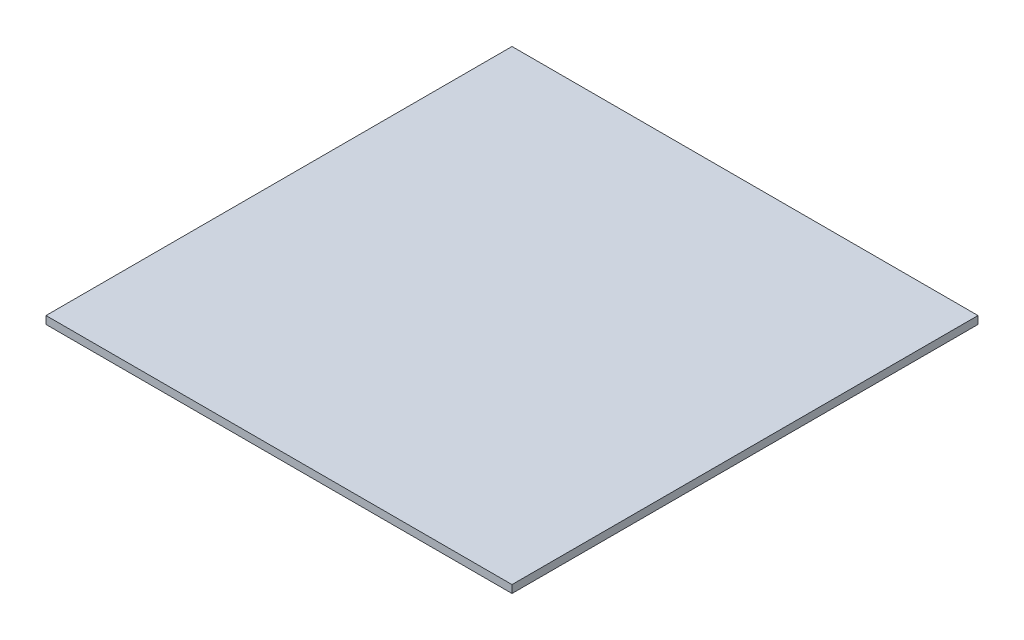
ISO-10303-21;
HEADER;
FILE_DESCRIPTION(('STEP AP214'),'2;1');
FILE_NAME('part.step','',(''),(''),'','','');
FILE_SCHEMA(('AUTOMOTIVE_DESIGN { 1 0 10303 214 1 1 1 1 }'));
ENDSEC;
DATA;
#1=APPLICATION_CONTEXT('core data for automotive mechanical design processes');
#2=APPLICATION_PROTOCOL_DEFINITION('international standard','automotive_design',2000,#1);
#3=PRODUCT_CONTEXT('',#1,'mechanical');
#4=PRODUCT('Part','Part','',(#3));
#5=PRODUCT_RELATED_PRODUCT_CATEGORY('part','',(#4));
#6=PRODUCT_DEFINITION_FORMATION('','',#4);
#7=PRODUCT_DEFINITION_CONTEXT('part definition',#1,'design');
#8=PRODUCT_DEFINITION('design','',#6,#7);
#9=PRODUCT_DEFINITION_SHAPE('','',#8);
#10=(LENGTH_UNIT() NAMED_UNIT(*) SI_UNIT(.MILLI.,.METRE.));
#11=(NAMED_UNIT(*) PLANE_ANGLE_UNIT() SI_UNIT($,.RADIAN.));
#12=(NAMED_UNIT(*) SI_UNIT($,.STERADIAN.) SOLID_ANGLE_UNIT());
#13=UNCERTAINTY_MEASURE_WITH_UNIT(LENGTH_MEASURE(1.E-05),#10,'distance_accuracy_value','');
#14=(GEOMETRIC_REPRESENTATION_CONTEXT(3) GLOBAL_UNCERTAINTY_ASSIGNED_CONTEXT((#13)) GLOBAL_UNIT_ASSIGNED_CONTEXT((#10,
#11,#12)) REPRESENTATION_CONTEXT('',''));
#15=CARTESIAN_POINT('',(0.,0.,0.));
#16=DIRECTION('',(0.,0.,1.));
#17=DIRECTION('',(1.,0.,0.));
#18=AXIS2_PLACEMENT_3D('',#15,#16,#17);
#19=CARTESIAN_POINT('',(-95.25,3.175,-95.25));
#20=DIRECTION('',(1.,0.,0.));
#21=DIRECTION('',(0.,0.,-1.));
#22=AXIS2_PLACEMENT_3D('',#19,#20,#21);
#23=PLANE('',#22);
#24=DIRECTION('',(0.,0.,1.));
#25=VECTOR('',#24,1.);
#26=CARTESIAN_POINT('',(-95.25,0.,-95.25));
#27=LINE('',#26,#25);
#28=CARTESIAN_POINT('',(-95.25,0.,-95.25));
#29=VERTEX_POINT('',#28);
#30=CARTESIAN_POINT('',(-95.25,0.,95.25));
#31=VERTEX_POINT('',#30);
#32=EDGE_CURVE('E96',#29,#31,#27,.T.);
#33=ORIENTED_EDGE('',*,*,#32,.T.);
#34=DIRECTION('',(0.,-1.,0.));
#35=VECTOR('',#34,1.);
#36=CARTESIAN_POINT('',(-95.25,3.175,95.25));
#37=LINE('',#36,#35);
#38=CARTESIAN_POINT('',(-95.25,3.175,95.25));
#39=VERTEX_POINT('',#38);
#40=EDGE_CURVE('E11',#39,#31,#37,.T.);
#41=ORIENTED_EDGE('',*,*,#40,.F.);
#42=DIRECTION('',(0.,0.,1.));
#43=VECTOR('',#42,1.);
#44=CARTESIAN_POINT('',(-95.25,3.175,-95.25));
#45=LINE('',#44,#43);
#46=CARTESIAN_POINT('',(-95.25,3.175,-95.25));
#47=VERTEX_POINT('',#46);
#48=EDGE_CURVE('E84',#47,#39,#45,.T.);
#49=ORIENTED_EDGE('',*,*,#48,.F.);
#50=DIRECTION('',(0.,-1.,0.));
#51=VECTOR('',#50,1.);
#52=CARTESIAN_POINT('',(-95.25,3.175,-95.25));
#53=LINE('',#52,#51);
#54=EDGE_CURVE('E92',#47,#29,#53,.T.);
#55=ORIENTED_EDGE('',*,*,#54,.T.);
#56=EDGE_LOOP('',(#33,#41,#49,#55));
#57=FACE_BOUND('',#56,.T.);
#58=ADVANCED_FACE('F33',(#57),#23,.F.);
#59=CARTESIAN_POINT('',(-95.25,3.175,95.25));
#60=DIRECTION('',(0.,0.,-1.));
#61=DIRECTION('',(-1.,0.,0.));
#62=AXIS2_PLACEMENT_3D('',#59,#60,#61);
#63=PLANE('',#62);
#64=DIRECTION('',(1.,0.,0.));
#65=VECTOR('',#64,1.);
#66=CARTESIAN_POINT('',(-95.25,0.,95.25));
#67=LINE('',#66,#65);
#68=CARTESIAN_POINT('',(95.25,0.,95.25));
#69=VERTEX_POINT('',#68);
#70=EDGE_CURVE('E88',#31,#69,#67,.T.);
#71=ORIENTED_EDGE('',*,*,#70,.T.);
#72=DIRECTION('',(0.,-1.,0.));
#73=VECTOR('',#72,1.);
#74=CARTESIAN_POINT('',(95.25,3.175,95.25));
#75=LINE('',#74,#73);
#76=CARTESIAN_POINT('',(95.25,3.175,95.25));
#77=VERTEX_POINT('',#76);
#78=EDGE_CURVE('E41',#77,#69,#75,.T.);
#79=ORIENTED_EDGE('',*,*,#78,.F.);
#80=DIRECTION('',(1.,0.,0.));
#81=VECTOR('',#80,1.);
#82=CARTESIAN_POINT('',(-95.25,3.175,95.25));
#83=LINE('',#82,#81);
#84=EDGE_CURVE('E79',#39,#77,#83,.T.);
#85=ORIENTED_EDGE('',*,*,#84,.F.);
#86=ORIENTED_EDGE('',*,*,#40,.T.);
#87=EDGE_LOOP('',(#71,#79,#85,#86));
#88=FACE_BOUND('',#87,.T.);
#89=ADVANCED_FACE('F87',(#88),#63,.F.);
#90=CARTESIAN_POINT('',(95.25,3.175,-95.25));
#91=DIRECTION('',(-1.,0.,0.));
#92=DIRECTION('',(0.,0.,1.));
#93=AXIS2_PLACEMENT_3D('',#90,#91,#92);
#94=PLANE('',#93);
#95=DIRECTION('',(0.,0.,-1.));
#96=VECTOR('',#95,1.);
#97=CARTESIAN_POINT('',(95.25,0.,-95.25));
#98=LINE('',#97,#96);
#99=CARTESIAN_POINT('',(95.25,0.,-95.25));
#100=VERTEX_POINT('',#99);
#101=EDGE_CURVE('E66',#69,#100,#98,.T.);
#102=ORIENTED_EDGE('',*,*,#101,.T.);
#103=DIRECTION('',(0.,-1.,0.));
#104=VECTOR('',#103,1.);
#105=CARTESIAN_POINT('',(95.25,3.175,-95.25));
#106=LINE('',#105,#104);
#107=CARTESIAN_POINT('',(95.25,3.175,-95.25));
#108=VERTEX_POINT('',#107);
#109=EDGE_CURVE('E89',#108,#100,#106,.T.);
#110=ORIENTED_EDGE('',*,*,#109,.F.);
#111=DIRECTION('',(0.,0.,-1.));
#112=VECTOR('',#111,1.);
#113=CARTESIAN_POINT('',(95.25,3.175,-95.25));
#114=LINE('',#113,#112);
#115=EDGE_CURVE('E82',#77,#108,#114,.T.);
#116=ORIENTED_EDGE('',*,*,#115,.F.);
#117=ORIENTED_EDGE('',*,*,#78,.T.);
#118=EDGE_LOOP('',(#102,#110,#116,#117));
#119=FACE_BOUND('',#118,.T.);
#120=ADVANCED_FACE('F90',(#119),#94,.F.);
#121=CARTESIAN_POINT('',(-95.25,3.175,-95.25));
#122=DIRECTION('',(0.,0.,1.));
#123=DIRECTION('',(1.,0.,0.));
#124=AXIS2_PLACEMENT_3D('',#121,#122,#123);
#125=PLANE('',#124);
#126=DIRECTION('',(-1.,0.,0.));
#127=VECTOR('',#126,1.);
#128=CARTESIAN_POINT('',(-95.25,0.,-95.25));
#129=LINE('',#128,#127);
#130=EDGE_CURVE('E72',#100,#29,#129,.T.);
#131=ORIENTED_EDGE('',*,*,#130,.T.);
#132=ORIENTED_EDGE('',*,*,#54,.F.);
#133=DIRECTION('',(-1.,0.,0.));
#134=VECTOR('',#133,1.);
#135=CARTESIAN_POINT('',(-95.25,3.175,-95.25));
#136=LINE('',#135,#134);
#137=EDGE_CURVE('E49',#108,#47,#136,.T.);
#138=ORIENTED_EDGE('',*,*,#137,.F.);
#139=ORIENTED_EDGE('',*,*,#109,.T.);
#140=EDGE_LOOP('',(#131,#132,#138,#139));
#141=FACE_BOUND('',#140,.T.);
#142=ADVANCED_FACE('F103',(#141),#125,.F.);
#143=CARTESIAN_POINT('',(0.,3.175,0.));
#144=DIRECTION('',(0.,1.,0.));
#145=DIRECTION('',(0.,0.,1.));
#146=AXIS2_PLACEMENT_3D('',#143,#144,#145);
#147=PLANE('',#146);
#148=ORIENTED_EDGE('',*,*,#48,.T.);
#149=ORIENTED_EDGE('',*,*,#84,.T.);
#150=ORIENTED_EDGE('',*,*,#115,.T.);
#151=ORIENTED_EDGE('',*,*,#137,.T.);
#152=EDGE_LOOP('',(#148,#149,#150,#151));
#153=FACE_BOUND('',#152,.T.);
#154=ADVANCED_FACE('F80',(#153),#147,.T.);
#155=CARTESIAN_POINT('',(0.,0.,0.));
#156=DIRECTION('',(0.,1.,0.));
#157=DIRECTION('',(0.,0.,1.));
#158=AXIS2_PLACEMENT_3D('',#155,#156,#157);
#159=PLANE('',#158);
#160=ORIENTED_EDGE('',*,*,#32,.F.);
#161=ORIENTED_EDGE('',*,*,#130,.F.);
#162=ORIENTED_EDGE('',*,*,#101,.F.);
#163=ORIENTED_EDGE('',*,*,#70,.F.);
#164=EDGE_LOOP('',(#160,#161,#162,#163));
#165=FACE_BOUND('',#164,.T.);
#166=ADVANCED_FACE('F106',(#165),#159,.F.);
#167=CLOSED_SHELL('',(#58,#89,#120,#142,#154,#166));
#168=MANIFOLD_SOLID_BREP('B2',#167);
#169=ADVANCED_BREP_SHAPE_REPRESENTATION('',(#18,#168),#14);
#170=SHAPE_DEFINITION_REPRESENTATION(#9,#169);
ENDSEC;
END-ISO-10303-21;
